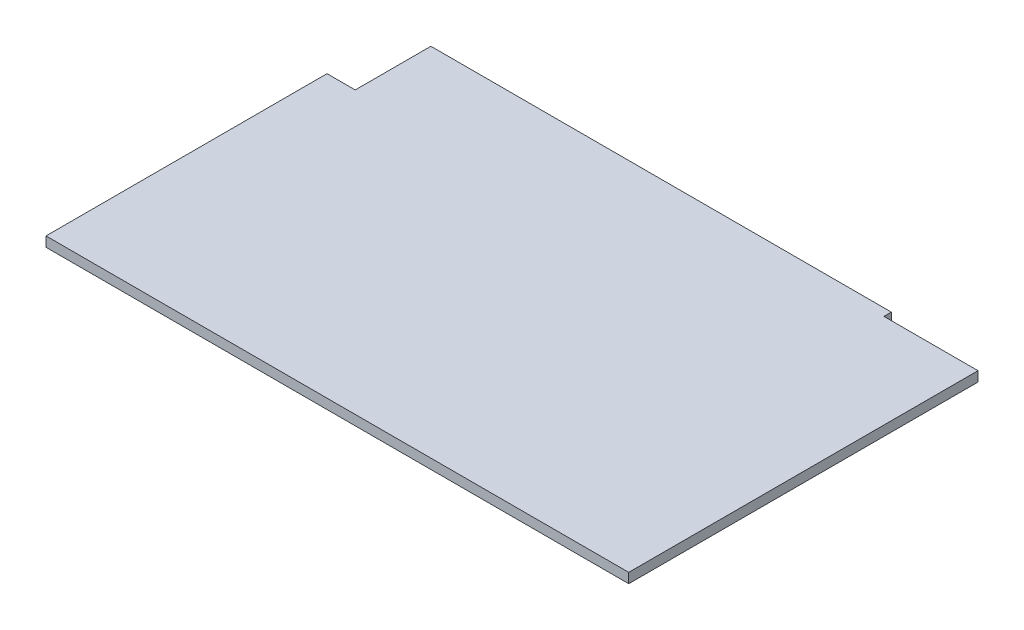
ISO-10303-21;
HEADER;
FILE_DESCRIPTION(('STEP AP214'),'2;1');
FILE_NAME('part.step','',(''),(''),'','','');
FILE_SCHEMA(('AUTOMOTIVE_DESIGN { 1 0 10303 214 1 1 1 1 }'));
ENDSEC;
DATA;
#1=APPLICATION_CONTEXT('core data for automotive mechanical design processes');
#2=APPLICATION_PROTOCOL_DEFINITION('international standard','automotive_design',2000,#1);
#3=PRODUCT_CONTEXT('',#1,'mechanical');
#4=PRODUCT('Part','Part','',(#3));
#5=PRODUCT_RELATED_PRODUCT_CATEGORY('part','',(#4));
#6=PRODUCT_DEFINITION_FORMATION('','',#4);
#7=PRODUCT_DEFINITION_CONTEXT('part definition',#1,'design');
#8=PRODUCT_DEFINITION('design','',#6,#7);
#9=PRODUCT_DEFINITION_SHAPE('','',#8);
#10=(LENGTH_UNIT() NAMED_UNIT(*) SI_UNIT(.MILLI.,.METRE.));
#11=(NAMED_UNIT(*) PLANE_ANGLE_UNIT() SI_UNIT($,.RADIAN.));
#12=(NAMED_UNIT(*) SI_UNIT($,.STERADIAN.) SOLID_ANGLE_UNIT());
#13=UNCERTAINTY_MEASURE_WITH_UNIT(LENGTH_MEASURE(1.E-05),#10,'distance_accuracy_value','');
#14=(GEOMETRIC_REPRESENTATION_CONTEXT(3) GLOBAL_UNCERTAINTY_ASSIGNED_CONTEXT((#13)) GLOBAL_UNIT_ASSIGNED_CONTEXT((#10,
#11,#12)) REPRESENTATION_CONTEXT('',''));
#15=CARTESIAN_POINT('',(0.,0.,0.));
#16=DIRECTION('',(0.,0.,1.));
#17=DIRECTION('',(1.,0.,0.));
#18=AXIS2_PLACEMENT_3D('',#15,#16,#17);
#19=CARTESIAN_POINT('',(157.49,2.67,0.));
#20=DIRECTION('',(0.,0.,-1.));
#21=DIRECTION('',(-1.,0.,0.));
#22=AXIS2_PLACEMENT_3D('',#19,#20,#21);
#23=PLANE('',#22);
#24=DIRECTION('',(1.,0.,0.));
#25=VECTOR('',#24,1.);
#26=CARTESIAN_POINT('',(157.49,0.,0.));
#27=LINE('',#26,#25);
#28=CARTESIAN_POINT('',(0.,0.,0.));
#29=VERTEX_POINT('',#28);
#30=CARTESIAN_POINT('',(157.49,0.,0.));
#31=VERTEX_POINT('',#30);
#32=EDGE_CURVE('E129',#29,#31,#27,.T.);
#33=ORIENTED_EDGE('',*,*,#32,.T.);
#34=DIRECTION('',(0.,-1.,0.));
#35=VECTOR('',#34,1.);
#36=CARTESIAN_POINT('',(157.49,2.67,0.));
#37=LINE('',#36,#35);
#38=CARTESIAN_POINT('',(157.49,2.67,0.));
#39=VERTEX_POINT('',#38);
#40=EDGE_CURVE('E11',#39,#31,#37,.T.);
#41=ORIENTED_EDGE('',*,*,#40,.F.);
#42=DIRECTION('',(1.,0.,0.));
#43=VECTOR('',#42,1.);
#44=CARTESIAN_POINT('',(157.49,2.67,0.));
#45=LINE('',#44,#43);
#46=CARTESIAN_POINT('',(0.,2.67,0.));
#47=VERTEX_POINT('',#46);
#48=EDGE_CURVE('E143',#47,#39,#45,.T.);
#49=ORIENTED_EDGE('',*,*,#48,.F.);
#50=DIRECTION('',(0.,-1.,0.));
#51=VECTOR('',#50,1.);
#52=CARTESIAN_POINT('',(0.,2.67,0.));
#53=LINE('',#52,#51);
#54=EDGE_CURVE('E125',#47,#29,#53,.T.);
#55=ORIENTED_EDGE('',*,*,#54,.T.);
#56=EDGE_LOOP('',(#33,#41,#49,#55));
#57=FACE_BOUND('',#56,.T.);
#58=ADVANCED_FACE('F33',(#57),#23,.F.);
#59=CARTESIAN_POINT('',(157.49,2.67,-94.4));
#60=DIRECTION('',(-1.,0.,0.));
#61=DIRECTION('',(0.,0.,1.));
#62=AXIS2_PLACEMENT_3D('',#59,#60,#61);
#63=PLANE('',#62);
#64=DIRECTION('',(0.,0.,-1.));
#65=VECTOR('',#64,1.);
#66=CARTESIAN_POINT('',(157.49,0.,-94.4));
#67=LINE('',#66,#65);
#68=CARTESIAN_POINT('',(157.49,0.,-94.4));
#69=VERTEX_POINT('',#68);
#70=EDGE_CURVE('E132',#31,#69,#67,.T.);
#71=ORIENTED_EDGE('',*,*,#70,.T.);
#72=DIRECTION('',(0.,-1.,0.));
#73=VECTOR('',#72,1.);
#74=CARTESIAN_POINT('',(157.49,2.67,-94.4));
#75=LINE('',#74,#73);
#76=CARTESIAN_POINT('',(157.49,2.67,-94.4));
#77=VERTEX_POINT('',#76);
#78=EDGE_CURVE('E41',#77,#69,#75,.T.);
#79=ORIENTED_EDGE('',*,*,#78,.F.);
#80=DIRECTION('',(0.,0.,-1.));
#81=VECTOR('',#80,1.);
#82=CARTESIAN_POINT('',(157.49,2.67,-94.4));
#83=LINE('',#82,#81);
#84=EDGE_CURVE('E92',#39,#77,#83,.T.);
#85=ORIENTED_EDGE('',*,*,#84,.F.);
#86=ORIENTED_EDGE('',*,*,#40,.T.);
#87=EDGE_LOOP('',(#71,#79,#85,#86));
#88=FACE_BOUND('',#87,.T.);
#89=ADVANCED_FACE('F178',(#88),#63,.F.);
#90=CARTESIAN_POINT('',(132.07,2.67,-94.4));
#91=DIRECTION('',(0.,0.,1.));
#92=DIRECTION('',(1.,0.,0.));
#93=AXIS2_PLACEMENT_3D('',#90,#91,#92);
#94=PLANE('',#93);
#95=DIRECTION('',(-1.,0.,0.));
#96=VECTOR('',#95,1.);
#97=CARTESIAN_POINT('',(132.07,0.,-94.4));
#98=LINE('',#97,#96);
#99=CARTESIAN_POINT('',(132.07,0.,-94.4));
#100=VERTEX_POINT('',#99);
#101=EDGE_CURVE('E134',#69,#100,#98,.T.);
#102=ORIENTED_EDGE('',*,*,#101,.T.);
#103=DIRECTION('',(0.,-1.,0.));
#104=VECTOR('',#103,1.);
#105=CARTESIAN_POINT('',(132.07,2.67,-94.4));
#106=LINE('',#105,#104);
#107=CARTESIAN_POINT('',(132.07,2.67,-94.4));
#108=VERTEX_POINT('',#107);
#109=EDGE_CURVE('E150',#108,#100,#106,.T.);
#110=ORIENTED_EDGE('',*,*,#109,.F.);
#111=DIRECTION('',(-1.,0.,0.));
#112=VECTOR('',#111,1.);
#113=CARTESIAN_POINT('',(132.07,2.67,-94.4));
#114=LINE('',#113,#112);
#115=EDGE_CURVE('E158',#77,#108,#114,.T.);
#116=ORIENTED_EDGE('',*,*,#115,.F.);
#117=ORIENTED_EDGE('',*,*,#78,.T.);
#118=EDGE_LOOP('',(#102,#110,#116,#117));
#119=FACE_BOUND('',#118,.T.);
#120=ADVANCED_FACE('F156',(#119),#94,.F.);
#121=CARTESIAN_POINT('',(132.07,2.67,-96.4));
#122=DIRECTION('',(-1.,0.,0.));
#123=DIRECTION('',(0.,0.,1.));
#124=AXIS2_PLACEMENT_3D('',#121,#122,#123);
#125=PLANE('',#124);
#126=DIRECTION('',(0.,0.,-1.));
#127=VECTOR('',#126,1.);
#128=CARTESIAN_POINT('',(132.07,0.,-96.4));
#129=LINE('',#128,#127);
#130=CARTESIAN_POINT('',(132.07,0.,-96.4));
#131=VERTEX_POINT('',#130);
#132=EDGE_CURVE('E136',#100,#131,#129,.T.);
#133=ORIENTED_EDGE('',*,*,#132,.T.);
#134=DIRECTION('',(0.,-1.,0.));
#135=VECTOR('',#134,1.);
#136=CARTESIAN_POINT('',(132.07,2.67,-96.4));
#137=LINE('',#136,#135);
#138=CARTESIAN_POINT('',(132.07,2.67,-96.4));
#139=VERTEX_POINT('',#138);
#140=EDGE_CURVE('E147',#139,#131,#137,.T.);
#141=ORIENTED_EDGE('',*,*,#140,.F.);
#142=DIRECTION('',(0.,0.,-1.));
#143=VECTOR('',#142,1.);
#144=CARTESIAN_POINT('',(132.07,2.67,-96.4));
#145=LINE('',#144,#143);
#146=EDGE_CURVE('E170',#108,#139,#145,.T.);
#147=ORIENTED_EDGE('',*,*,#146,.F.);
#148=ORIENTED_EDGE('',*,*,#109,.T.);
#149=EDGE_LOOP('',(#133,#141,#147,#148));
#150=FACE_BOUND('',#149,.T.);
#151=ADVANCED_FACE('F166',(#150),#125,.F.);
#152=CARTESIAN_POINT('',(7.62,2.67,-96.4));
#153=DIRECTION('',(0.,0.,1.));
#154=DIRECTION('',(1.,0.,0.));
#155=AXIS2_PLACEMENT_3D('',#152,#153,#154);
#156=PLANE('',#155);
#157=DIRECTION('',(-1.,0.,0.));
#158=VECTOR('',#157,1.);
#159=CARTESIAN_POINT('',(7.62,0.,-96.4));
#160=LINE('',#159,#158);
#161=CARTESIAN_POINT('',(7.62,0.,-96.4));
#162=VERTEX_POINT('',#161);
#163=EDGE_CURVE('E138',#131,#162,#160,.T.);
#164=ORIENTED_EDGE('',*,*,#163,.T.);
#165=DIRECTION('',(0.,-1.,0.));
#166=VECTOR('',#165,1.);
#167=CARTESIAN_POINT('',(7.62,2.67,-96.4));
#168=LINE('',#167,#166);
#169=CARTESIAN_POINT('',(7.62,2.67,-96.4));
#170=VERTEX_POINT('',#169);
#171=EDGE_CURVE('E120',#170,#162,#168,.T.);
#172=ORIENTED_EDGE('',*,*,#171,.F.);
#173=DIRECTION('',(-1.,0.,0.));
#174=VECTOR('',#173,1.);
#175=CARTESIAN_POINT('',(7.62,2.67,-96.4));
#176=LINE('',#175,#174);
#177=EDGE_CURVE('E111',#139,#170,#176,.T.);
#178=ORIENTED_EDGE('',*,*,#177,.F.);
#179=ORIENTED_EDGE('',*,*,#140,.T.);
#180=EDGE_LOOP('',(#164,#172,#178,#179));
#181=FACE_BOUND('',#180,.T.);
#182=ADVANCED_FACE('F169',(#181),#156,.F.);
#183=CARTESIAN_POINT('',(7.62,2.67,-75.95));
#184=DIRECTION('',(1.,0.,0.));
#185=DIRECTION('',(0.,0.,-1.));
#186=AXIS2_PLACEMENT_3D('',#183,#184,#185);
#187=PLANE('',#186);
#188=DIRECTION('',(0.,0.,1.));
#189=VECTOR('',#188,1.);
#190=CARTESIAN_POINT('',(7.62,0.,-75.95));
#191=LINE('',#190,#189);
#192=CARTESIAN_POINT('',(7.62,0.,-75.95));
#193=VERTEX_POINT('',#192);
#194=EDGE_CURVE('E119',#162,#193,#191,.T.);
#195=ORIENTED_EDGE('',*,*,#194,.T.);
#196=DIRECTION('',(0.,-1.,0.));
#197=VECTOR('',#196,1.);
#198=CARTESIAN_POINT('',(7.62,2.67,-75.95));
#199=LINE('',#198,#197);
#200=CARTESIAN_POINT('',(7.62,2.67,-75.95));
#201=VERTEX_POINT('',#200);
#202=EDGE_CURVE('E116',#201,#193,#199,.T.);
#203=ORIENTED_EDGE('',*,*,#202,.F.);
#204=DIRECTION('',(0.,0.,1.));
#205=VECTOR('',#204,1.);
#206=CARTESIAN_POINT('',(7.62,2.67,-75.95));
#207=LINE('',#206,#205);
#208=EDGE_CURVE('E105',#170,#201,#207,.T.);
#209=ORIENTED_EDGE('',*,*,#208,.F.);
#210=ORIENTED_EDGE('',*,*,#171,.T.);
#211=EDGE_LOOP('',(#195,#203,#209,#210));
#212=FACE_BOUND('',#211,.T.);
#213=ADVANCED_FACE('F117',(#212),#187,.F.);
#214=CARTESIAN_POINT('',(0.,2.67,-75.95));
#215=DIRECTION('',(0.,0.,1.));
#216=DIRECTION('',(1.,0.,0.));
#217=AXIS2_PLACEMENT_3D('',#214,#215,#216);
#218=PLANE('',#217);
#219=DIRECTION('',(-1.,0.,0.));
#220=VECTOR('',#219,1.);
#221=CARTESIAN_POINT('',(0.,0.,-75.95));
#222=LINE('',#221,#220);
#223=CARTESIAN_POINT('',(0.,0.,-75.95));
#224=VERTEX_POINT('',#223);
#225=EDGE_CURVE('E78',#193,#224,#222,.T.);
#226=ORIENTED_EDGE('',*,*,#225,.T.);
#227=DIRECTION('',(0.,-1.,0.));
#228=VECTOR('',#227,1.);
#229=CARTESIAN_POINT('',(0.,2.67,-75.95));
#230=LINE('',#229,#228);
#231=CARTESIAN_POINT('',(0.,2.67,-75.95));
#232=VERTEX_POINT('',#231);
#233=EDGE_CURVE('E121',#232,#224,#230,.T.);
#234=ORIENTED_EDGE('',*,*,#233,.F.);
#235=DIRECTION('',(-1.,0.,0.));
#236=VECTOR('',#235,1.);
#237=CARTESIAN_POINT('',(0.,2.67,-75.95));
#238=LINE('',#237,#236);
#239=EDGE_CURVE('E109',#201,#232,#238,.T.);
#240=ORIENTED_EDGE('',*,*,#239,.F.);
#241=ORIENTED_EDGE('',*,*,#202,.T.);
#242=EDGE_LOOP('',(#226,#234,#240,#241));
#243=FACE_BOUND('',#242,.T.);
#244=ADVANCED_FACE('F123',(#243),#218,.F.);
#245=CARTESIAN_POINT('',(0.,2.67,0.));
#246=DIRECTION('',(1.,0.,0.));
#247=DIRECTION('',(0.,0.,-1.));
#248=AXIS2_PLACEMENT_3D('',#245,#246,#247);
#249=PLANE('',#248);
#250=DIRECTION('',(0.,0.,1.));
#251=VECTOR('',#250,1.);
#252=CARTESIAN_POINT('',(0.,0.,0.));
#253=LINE('',#252,#251);
#254=EDGE_CURVE('E84',#224,#29,#253,.T.);
#255=ORIENTED_EDGE('',*,*,#254,.T.);
#256=ORIENTED_EDGE('',*,*,#54,.F.);
#257=DIRECTION('',(0.,0.,1.));
#258=VECTOR('',#257,1.);
#259=CARTESIAN_POINT('',(0.,2.67,0.));
#260=LINE('',#259,#258);
#261=EDGE_CURVE('E49',#232,#47,#260,.T.);
#262=ORIENTED_EDGE('',*,*,#261,.F.);
#263=ORIENTED_EDGE('',*,*,#233,.T.);
#264=EDGE_LOOP('',(#255,#256,#262,#263));
#265=FACE_BOUND('',#264,.T.);
#266=ADVANCED_FACE('F194',(#265),#249,.F.);
#267=CARTESIAN_POINT('',(0.,2.67,0.));
#268=DIRECTION('',(0.,-1.,0.));
#269=DIRECTION('',(0.,0.,-1.));
#270=AXIS2_PLACEMENT_3D('',#267,#268,#269);
#271=PLANE('',#270);
#272=ORIENTED_EDGE('',*,*,#48,.T.);
#273=ORIENTED_EDGE('',*,*,#84,.T.);
#274=ORIENTED_EDGE('',*,*,#115,.T.);
#275=ORIENTED_EDGE('',*,*,#146,.T.);
#276=ORIENTED_EDGE('',*,*,#177,.T.);
#277=ORIENTED_EDGE('',*,*,#208,.T.);
#278=ORIENTED_EDGE('',*,*,#239,.T.);
#279=ORIENTED_EDGE('',*,*,#261,.T.);
#280=EDGE_LOOP('',(#272,#273,#274,#275,#276,#277,#278,#279));
#281=FACE_BOUND('',#280,.T.);
#282=ADVANCED_FACE('F107',(#281),#271,.F.);
#283=CARTESIAN_POINT('',(0.,0.,0.));
#284=DIRECTION('',(0.,-1.,0.));
#285=DIRECTION('',(0.,0.,-1.));
#286=AXIS2_PLACEMENT_3D('',#283,#284,#285);
#287=PLANE('',#286);
#288=ORIENTED_EDGE('',*,*,#32,.F.);
#289=ORIENTED_EDGE('',*,*,#254,.F.);
#290=ORIENTED_EDGE('',*,*,#225,.F.);
#291=ORIENTED_EDGE('',*,*,#194,.F.);
#292=ORIENTED_EDGE('',*,*,#163,.F.);
#293=ORIENTED_EDGE('',*,*,#132,.F.);
#294=ORIENTED_EDGE('',*,*,#101,.F.);
#295=ORIENTED_EDGE('',*,*,#70,.F.);
#296=EDGE_LOOP('',(#288,#289,#290,#291,#292,#293,#294,#295));
#297=FACE_BOUND('',#296,.T.);
#298=ADVANCED_FACE('F162',(#297),#287,.T.);
#299=CLOSED_SHELL('',(#58,#89,#120,#151,#182,#213,#244,#266,#282,#298));
#300=MANIFOLD_SOLID_BREP('B2',#299);
#301=ADVANCED_BREP_SHAPE_REPRESENTATION('',(#18,#300),#14);
#302=SHAPE_DEFINITION_REPRESENTATION(#9,#301);
ENDSEC;
END-ISO-10303-21;
